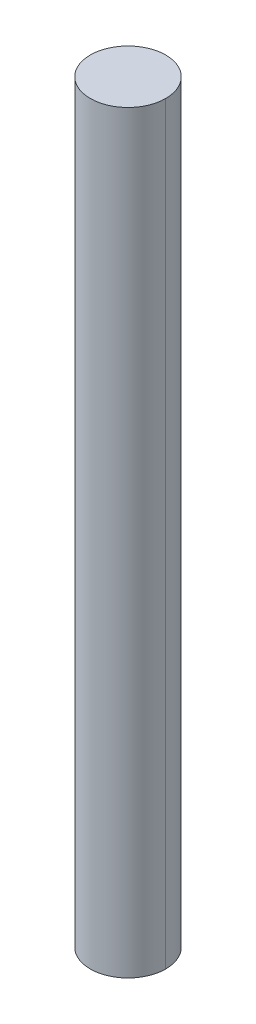
ISO-10303-21;
HEADER;
FILE_DESCRIPTION(('STEP AP214'),'2;1');
FILE_NAME('part.step','',(''),(''),'','','');
FILE_SCHEMA(('AUTOMOTIVE_DESIGN { 1 0 10303 214 1 1 1 1 }'));
ENDSEC;
DATA;
#1=APPLICATION_CONTEXT('core data for automotive mechanical design processes');
#2=APPLICATION_PROTOCOL_DEFINITION('international standard','automotive_design',2000,#1);
#3=PRODUCT_CONTEXT('',#1,'mechanical');
#4=PRODUCT('Part','Part','',(#3));
#5=PRODUCT_RELATED_PRODUCT_CATEGORY('part','',(#4));
#6=PRODUCT_DEFINITION_FORMATION('','',#4);
#7=PRODUCT_DEFINITION_CONTEXT('part definition',#1,'design');
#8=PRODUCT_DEFINITION('design','',#6,#7);
#9=PRODUCT_DEFINITION_SHAPE('','',#8);
#10=(LENGTH_UNIT() NAMED_UNIT(*) SI_UNIT(.MILLI.,.METRE.));
#11=(NAMED_UNIT(*) PLANE_ANGLE_UNIT() SI_UNIT($,.RADIAN.));
#12=(NAMED_UNIT(*) SI_UNIT($,.STERADIAN.) SOLID_ANGLE_UNIT());
#13=UNCERTAINTY_MEASURE_WITH_UNIT(LENGTH_MEASURE(1.E-05),#10,'distance_accuracy_value','');
#14=(GEOMETRIC_REPRESENTATION_CONTEXT(3) GLOBAL_UNCERTAINTY_ASSIGNED_CONTEXT((#13)) GLOBAL_UNIT_ASSIGNED_CONTEXT((#10,
#11,#12)) REPRESENTATION_CONTEXT('',''));
#15=CARTESIAN_POINT('',(0.,0.,0.));
#16=DIRECTION('',(0.,0.,1.));
#17=DIRECTION('',(1.,0.,0.));
#18=AXIS2_PLACEMENT_3D('',#15,#16,#17);
#19=CARTESIAN_POINT('',(6.5,20.,0.));
#20=DIRECTION('',(0.,1.,0.));
#21=DIRECTION('',(0.,0.,1.));
#22=AXIS2_PLACEMENT_3D('',#19,#20,#21);
#23=PLANE('',#22);
#24=CARTESIAN_POINT('',(5.5,20.,0.));
#25=DIRECTION('',(0.,-1.,0.));
#26=DIRECTION('',(0.,0.,-1.));
#27=AXIS2_PLACEMENT_3D('',#24,#25,#26);
#28=CIRCLE('',#27,2.);
#29=CARTESIAN_POINT('',(7.5,20.,0.));
#30=VERTEX_POINT('',#29);
#31=CARTESIAN_POINT('',(3.5,20.,0.));
#32=VERTEX_POINT('',#31);
#33=EDGE_CURVE('E47',#30,#32,#28,.T.);
#34=ORIENTED_EDGE('',*,*,#33,.F.);
#35=CARTESIAN_POINT('',(5.5,20.,0.));
#36=DIRECTION('',(0.,-1.,0.));
#37=DIRECTION('',(0.,0.,-1.));
#38=AXIS2_PLACEMENT_3D('',#35,#36,#37);
#39=CIRCLE('',#38,2.);
#40=EDGE_CURVE('E19',#32,#30,#39,.T.);
#41=ORIENTED_EDGE('',*,*,#40,.F.);
#42=EDGE_LOOP('',(#34,#41));
#43=FACE_BOUND('',#42,.T.);
#44=ADVANCED_FACE('F16',(#43),#23,.T.);
#45=CARTESIAN_POINT('',(5.5,0.,0.));
#46=DIRECTION('',(0.,-1.,0.));
#47=DIRECTION('',(0.,0.,-1.));
#48=AXIS2_PLACEMENT_3D('',#45,#46,#47);
#49=CYLINDRICAL_SURFACE('',#48,2.);
#50=DIRECTION('',(0.,-1.,0.));
#51=VECTOR('',#50,1.);
#52=CARTESIAN_POINT('',(3.5,0.,0.));
#53=LINE('',#52,#51);
#54=CARTESIAN_POINT('',(3.5,-20.,0.));
#55=VERTEX_POINT('',#54);
#56=EDGE_CURVE('E25',#32,#55,#53,.T.);
#57=ORIENTED_EDGE('',*,*,#56,.F.);
#58=ORIENTED_EDGE('',*,*,#40,.T.);
#59=DIRECTION('',(0.,-1.,0.));
#60=VECTOR('',#59,1.);
#61=CARTESIAN_POINT('',(7.5,0.,0.));
#62=LINE('',#61,#60);
#63=CARTESIAN_POINT('',(7.5,-20.,0.));
#64=VERTEX_POINT('',#63);
#65=EDGE_CURVE('E41',#64,#30,#62,.F.);
#66=ORIENTED_EDGE('',*,*,#65,.F.);
#67=CARTESIAN_POINT('',(5.5,-20.,0.));
#68=DIRECTION('',(0.,-1.,0.));
#69=DIRECTION('',(0.,0.,-1.));
#70=AXIS2_PLACEMENT_3D('',#67,#68,#69);
#71=CIRCLE('',#70,2.);
#72=EDGE_CURVE('E34',#55,#64,#71,.T.);
#73=ORIENTED_EDGE('',*,*,#72,.F.);
#74=EDGE_LOOP('',(#57,#58,#66,#73));
#75=FACE_BOUND('',#74,.T.);
#76=ADVANCED_FACE('F43',(#75),#49,.T.);
#77=CARTESIAN_POINT('',(6.5,-20.,0.));
#78=DIRECTION('',(0.,-1.,0.));
#79=DIRECTION('',(0.,0.,-1.));
#80=AXIS2_PLACEMENT_3D('',#77,#78,#79);
#81=PLANE('',#80);
#82=CARTESIAN_POINT('',(5.5,-20.,0.));
#83=DIRECTION('',(0.,-1.,0.));
#84=DIRECTION('',(0.,0.,-1.));
#85=AXIS2_PLACEMENT_3D('',#82,#83,#84);
#86=CIRCLE('',#85,2.);
#87=EDGE_CURVE('E10',#55,#64,#86,.F.);
#88=ORIENTED_EDGE('',*,*,#87,.F.);
#89=ORIENTED_EDGE('',*,*,#72,.T.);
#90=EDGE_LOOP('',(#88,#89));
#91=FACE_BOUND('',#90,.T.);
#92=ADVANCED_FACE('F54',(#91),#81,.T.);
#93=CARTESIAN_POINT('',(5.5,0.,0.));
#94=DIRECTION('',(0.,-1.,0.));
#95=DIRECTION('',(0.,0.,-1.));
#96=AXIS2_PLACEMENT_3D('',#93,#94,#95);
#97=CYLINDRICAL_SURFACE('',#96,2.);
#98=ORIENTED_EDGE('',*,*,#56,.T.);
#99=ORIENTED_EDGE('',*,*,#87,.T.);
#100=ORIENTED_EDGE('',*,*,#65,.T.);
#101=ORIENTED_EDGE('',*,*,#33,.T.);
#102=EDGE_LOOP('',(#98,#99,#100,#101));
#103=FACE_BOUND('',#102,.T.);
#104=ADVANCED_FACE('F50',(#103),#97,.T.);
#105=CLOSED_SHELL('',(#44,#76,#92,#104));
#106=MANIFOLD_SOLID_BREP('B1',#105);
#107=ADVANCED_BREP_SHAPE_REPRESENTATION('',(#18,#106),#14);
#108=SHAPE_DEFINITION_REPRESENTATION(#9,#107);
ENDSEC;
END-ISO-10303-21;
